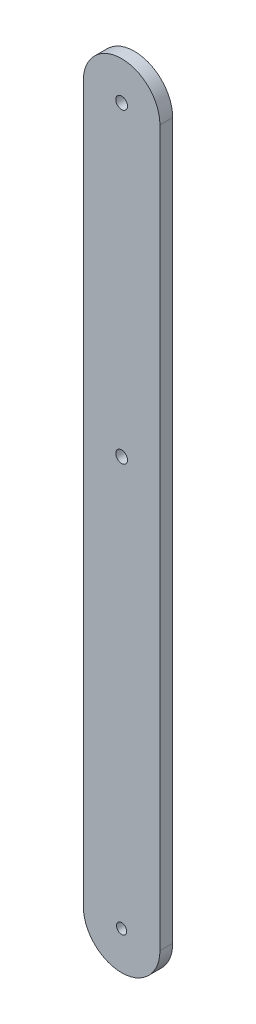
ISO-10303-21;
HEADER;
FILE_DESCRIPTION(('STEP AP214'),'2;1');
FILE_NAME('part.step','',(''),(''),'','','');
FILE_SCHEMA(('AUTOMOTIVE_DESIGN { 1 0 10303 214 1 1 1 1 }'));
ENDSEC;
DATA;
#1=APPLICATION_CONTEXT('core data for automotive mechanical design processes');
#2=APPLICATION_PROTOCOL_DEFINITION('international standard','automotive_design',2000,#1);
#3=PRODUCT_CONTEXT('',#1,'mechanical');
#4=PRODUCT('Part','Part','',(#3));
#5=PRODUCT_RELATED_PRODUCT_CATEGORY('part','',(#4));
#6=PRODUCT_DEFINITION_FORMATION('','',#4);
#7=PRODUCT_DEFINITION_CONTEXT('part definition',#1,'design');
#8=PRODUCT_DEFINITION('design','',#6,#7);
#9=PRODUCT_DEFINITION_SHAPE('','',#8);
#10=(LENGTH_UNIT() NAMED_UNIT(*) SI_UNIT(.MILLI.,.METRE.));
#11=(NAMED_UNIT(*) PLANE_ANGLE_UNIT() SI_UNIT($,.RADIAN.));
#12=(NAMED_UNIT(*) SI_UNIT($,.STERADIAN.) SOLID_ANGLE_UNIT());
#13=UNCERTAINTY_MEASURE_WITH_UNIT(LENGTH_MEASURE(1.E-05),#10,'distance_accuracy_value','');
#14=(GEOMETRIC_REPRESENTATION_CONTEXT(3) GLOBAL_UNCERTAINTY_ASSIGNED_CONTEXT((#13)) GLOBAL_UNIT_ASSIGNED_CONTEXT((#10,
#11,#12)) REPRESENTATION_CONTEXT('',''));
#15=CARTESIAN_POINT('',(0.,0.,0.));
#16=DIRECTION('',(0.,0.,1.));
#17=DIRECTION('',(1.,0.,0.));
#18=AXIS2_PLACEMENT_3D('',#15,#16,#17);
#19=CARTESIAN_POINT('',(-9.82801288749564,-25.4,3.175));
#20=DIRECTION('',(0.,0.,1.));
#21=DIRECTION('',(1.,0.,0.));
#22=AXIS2_PLACEMENT_3D('',#19,#20,#21);
#23=PLANE('',#22);
#24=CARTESIAN_POINT('',(-9.82801288749564,-25.4,3.175));
#25=DIRECTION('',(0.,0.,1.));
#26=DIRECTION('',(1.,0.,0.));
#27=AXIS2_PLACEMENT_3D('',#24,#25,#26);
#28=CIRCLE('',#27,1.27);
#29=CARTESIAN_POINT('',(-8.55801288749563,-25.4,3.175));
#30=VERTEX_POINT('',#29);
#31=EDGE_CURVE('E115',#30,#30,#28,.T.);
#32=ORIENTED_EDGE('',*,*,#31,.F.);
#33=EDGE_LOOP('',(#32));
#34=FACE_BOUND('',#33,.T.);
#35=CARTESIAN_POINT('',(-9.82801288749564,-25.4,3.175));
#36=DIRECTION('',(0.,0.,1.));
#37=DIRECTION('',(1.,0.,0.));
#38=AXIS2_PLACEMENT_3D('',#35,#36,#37);
#39=CIRCLE('',#38,9.52499999999999);
#40=CARTESIAN_POINT('',(-19.3530128874956,-25.4,3.175));
#41=VERTEX_POINT('',#40);
#42=CARTESIAN_POINT('',(-0.303012887495655,-25.4,3.175));
#43=VERTEX_POINT('',#42);
#44=EDGE_CURVE('E85',#41,#43,#39,.T.);
#45=ORIENTED_EDGE('',*,*,#44,.T.);
#46=DIRECTION('',(0.,1.,0.));
#47=VECTOR('',#46,1.);
#48=CARTESIAN_POINT('',(-0.303012887495678,152.4,3.175));
#49=LINE('',#48,#47);
#50=CARTESIAN_POINT('',(-0.303012887495699,152.4,3.175));
#51=VERTEX_POINT('',#50);
#52=EDGE_CURVE('E80',#43,#51,#49,.T.);
#53=ORIENTED_EDGE('',*,*,#52,.T.);
#54=CARTESIAN_POINT('',(-9.82801288749568,152.4,3.175));
#55=DIRECTION('',(0.,0.,1.));
#56=DIRECTION('',(-1.,0.,0.));
#57=AXIS2_PLACEMENT_3D('',#54,#55,#56);
#58=CIRCLE('',#57,9.52499999999998);
#59=CARTESIAN_POINT('',(-19.3530128874956,152.4,3.175));
#60=VERTEX_POINT('',#59);
#61=EDGE_CURVE('E83',#51,#60,#58,.T.);
#62=ORIENTED_EDGE('',*,*,#61,.T.);
#63=DIRECTION('',(0.,-1.,0.));
#64=VECTOR('',#63,1.);
#65=CARTESIAN_POINT('',(-19.3530128874956,-25.4,3.175));
#66=LINE('',#65,#64);
#67=EDGE_CURVE('E50',#60,#41,#66,.T.);
#68=ORIENTED_EDGE('',*,*,#67,.T.);
#69=EDGE_LOOP('',(#45,#53,#62,#68));
#70=FACE_BOUND('',#69,.T.);
#71=CARTESIAN_POINT('',(-9.82801288749568,152.4,3.175));
#72=DIRECTION('',(0.,0.,1.));
#73=DIRECTION('',(1.,0.,0.));
#74=AXIS2_PLACEMENT_3D('',#71,#72,#73);
#75=CIRCLE('',#74,1.4605);
#76=CARTESIAN_POINT('',(-8.36751288749568,152.4,3.175));
#77=VERTEX_POINT('',#76);
#78=EDGE_CURVE('E100',#77,#77,#75,.T.);
#79=ORIENTED_EDGE('',*,*,#78,.F.);
#80=EDGE_LOOP('',(#79));
#81=FACE_BOUND('',#80,.T.);
#82=CARTESIAN_POINT('',(-9.82801288749567,76.2,3.175));
#83=DIRECTION('',(0.,0.,1.));
#84=DIRECTION('',(1.,0.,0.));
#85=AXIS2_PLACEMENT_3D('',#82,#83,#84);
#86=CIRCLE('',#85,1.4605);
#87=CARTESIAN_POINT('',(-8.36751288749567,76.2,3.175));
#88=VERTEX_POINT('',#87);
#89=EDGE_CURVE('E121',#88,#88,#86,.T.);
#90=ORIENTED_EDGE('',*,*,#89,.F.);
#91=EDGE_LOOP('',(#90));
#92=FACE_BOUND('',#91,.T.);
#93=ADVANCED_FACE('F33',(#34,#70,#81,#92),#23,.T.);
#94=CARTESIAN_POINT('',(-9.82801288749564,-25.4,0.));
#95=DIRECTION('',(0.,0.,1.));
#96=DIRECTION('',(1.,0.,0.));
#97=AXIS2_PLACEMENT_3D('',#94,#95,#96);
#98=PLANE('',#97);
#99=CARTESIAN_POINT('',(-9.82801288749564,-25.4,0.));
#100=DIRECTION('',(0.,0.,1.));
#101=DIRECTION('',(1.,0.,0.));
#102=AXIS2_PLACEMENT_3D('',#99,#100,#101);
#103=CIRCLE('',#102,9.52499999999999);
#104=CARTESIAN_POINT('',(-19.3530128874956,-25.4,0.));
#105=VERTEX_POINT('',#104);
#106=CARTESIAN_POINT('',(-0.303012887495655,-25.4,0.));
#107=VERTEX_POINT('',#106);
#108=EDGE_CURVE('E97',#105,#107,#103,.T.);
#109=ORIENTED_EDGE('',*,*,#108,.F.);
#110=DIRECTION('',(0.,-1.,0.));
#111=VECTOR('',#110,1.);
#112=CARTESIAN_POINT('',(-19.3530128874956,-25.4,0.));
#113=LINE('',#112,#111);
#114=CARTESIAN_POINT('',(-19.3530128874956,152.4,0.));
#115=VERTEX_POINT('',#114);
#116=EDGE_CURVE('E73',#115,#105,#113,.T.);
#117=ORIENTED_EDGE('',*,*,#116,.F.);
#118=CARTESIAN_POINT('',(-9.82801288749568,152.4,0.));
#119=DIRECTION('',(0.,0.,1.));
#120=DIRECTION('',(-1.,0.,0.));
#121=AXIS2_PLACEMENT_3D('',#118,#119,#120);
#122=CIRCLE('',#121,9.52499999999998);
#123=CARTESIAN_POINT('',(-0.303012887495699,152.4,0.));
#124=VERTEX_POINT('',#123);
#125=EDGE_CURVE('E67',#124,#115,#122,.T.);
#126=ORIENTED_EDGE('',*,*,#125,.F.);
#127=DIRECTION('',(0.,1.,0.));
#128=VECTOR('',#127,1.);
#129=CARTESIAN_POINT('',(-0.303012887495678,152.4,0.));
#130=LINE('',#129,#128);
#131=EDGE_CURVE('E89',#107,#124,#130,.T.);
#132=ORIENTED_EDGE('',*,*,#131,.F.);
#133=EDGE_LOOP('',(#109,#117,#126,#132));
#134=FACE_BOUND('',#133,.T.);
#135=CARTESIAN_POINT('',(-9.82801288749568,152.4,0.));
#136=DIRECTION('',(0.,0.,1.));
#137=DIRECTION('',(1.,0.,0.));
#138=AXIS2_PLACEMENT_3D('',#135,#136,#137);
#139=CIRCLE('',#138,1.4605);
#140=CARTESIAN_POINT('',(-8.36751288749568,152.4,0.));
#141=VERTEX_POINT('',#140);
#142=EDGE_CURVE('E112',#141,#141,#139,.T.);
#143=ORIENTED_EDGE('',*,*,#142,.T.);
#144=EDGE_LOOP('',(#143));
#145=FACE_BOUND('',#144,.T.);
#146=CARTESIAN_POINT('',(-9.82801288749564,-25.4,0.));
#147=DIRECTION('',(0.,0.,1.));
#148=DIRECTION('',(1.,0.,0.));
#149=AXIS2_PLACEMENT_3D('',#146,#147,#148);
#150=CIRCLE('',#149,1.27);
#151=CARTESIAN_POINT('',(-8.55801288749563,-25.4,0.));
#152=VERTEX_POINT('',#151);
#153=EDGE_CURVE('E118',#152,#152,#150,.T.);
#154=ORIENTED_EDGE('',*,*,#153,.T.);
#155=EDGE_LOOP('',(#154));
#156=FACE_BOUND('',#155,.T.);
#157=CARTESIAN_POINT('',(-9.82801288749567,76.2,0.));
#158=DIRECTION('',(0.,0.,1.));
#159=DIRECTION('',(1.,0.,0.));
#160=AXIS2_PLACEMENT_3D('',#157,#158,#159);
#161=CIRCLE('',#160,1.4605);
#162=CARTESIAN_POINT('',(-8.36751288749567,76.2,0.));
#163=VERTEX_POINT('',#162);
#164=EDGE_CURVE('E124',#163,#163,#161,.T.);
#165=ORIENTED_EDGE('',*,*,#164,.T.);
#166=EDGE_LOOP('',(#165));
#167=FACE_BOUND('',#166,.T.);
#168=ADVANCED_FACE('F108',(#134,#145,#156,#167),#98,.F.);
#169=CARTESIAN_POINT('',(-9.82801288749564,-25.4,3.175));
#170=DIRECTION('',(0.,0.,-1.));
#171=DIRECTION('',(-1.,0.,0.));
#172=AXIS2_PLACEMENT_3D('',#169,#170,#171);
#173=CYLINDRICAL_SURFACE('',#172,9.52499999999999);
#174=ORIENTED_EDGE('',*,*,#108,.T.);
#175=DIRECTION('',(0.,0.,-1.));
#176=VECTOR('',#175,1.);
#177=CARTESIAN_POINT('',(-0.303012887495655,-25.4,3.175));
#178=LINE('',#177,#176);
#179=EDGE_CURVE('E11',#43,#107,#178,.T.);
#180=ORIENTED_EDGE('',*,*,#179,.F.);
#181=ORIENTED_EDGE('',*,*,#44,.F.);
#182=DIRECTION('',(0.,0.,-1.));
#183=VECTOR('',#182,1.);
#184=CARTESIAN_POINT('',(-19.3530128874956,-25.4,3.175));
#185=LINE('',#184,#183);
#186=EDGE_CURVE('E93',#41,#105,#185,.T.);
#187=ORIENTED_EDGE('',*,*,#186,.T.);
#188=EDGE_LOOP('',(#174,#180,#181,#187));
#189=FACE_BOUND('',#188,.T.);
#190=ADVANCED_FACE('F35',(#189),#173,.T.);
#191=CARTESIAN_POINT('',(-0.303012887495678,152.4,3.175));
#192=DIRECTION('',(-1.,0.,0.));
#193=DIRECTION('',(0.,-1.,0.));
#194=AXIS2_PLACEMENT_3D('',#191,#192,#193);
#195=PLANE('',#194);
#196=ORIENTED_EDGE('',*,*,#131,.T.);
#197=DIRECTION('',(0.,0.,-1.));
#198=VECTOR('',#197,1.);
#199=CARTESIAN_POINT('',(-0.303012887495699,152.4,3.175));
#200=LINE('',#199,#198);
#201=EDGE_CURVE('E42',#51,#124,#200,.T.);
#202=ORIENTED_EDGE('',*,*,#201,.F.);
#203=ORIENTED_EDGE('',*,*,#52,.F.);
#204=ORIENTED_EDGE('',*,*,#179,.T.);
#205=EDGE_LOOP('',(#196,#202,#203,#204));
#206=FACE_BOUND('',#205,.T.);
#207=ADVANCED_FACE('F88',(#206),#195,.F.);
#208=CARTESIAN_POINT('',(-9.82801288749568,152.4,3.175));
#209=DIRECTION('',(0.,0.,-1.));
#210=DIRECTION('',(-1.,0.,0.));
#211=AXIS2_PLACEMENT_3D('',#208,#209,#210);
#212=CYLINDRICAL_SURFACE('',#211,9.52499999999998);
#213=ORIENTED_EDGE('',*,*,#125,.T.);
#214=DIRECTION('',(0.,0.,-1.));
#215=VECTOR('',#214,1.);
#216=CARTESIAN_POINT('',(-19.3530128874956,152.4,3.175));
#217=LINE('',#216,#215);
#218=EDGE_CURVE('E90',#60,#115,#217,.T.);
#219=ORIENTED_EDGE('',*,*,#218,.F.);
#220=ORIENTED_EDGE('',*,*,#61,.F.);
#221=ORIENTED_EDGE('',*,*,#201,.T.);
#222=EDGE_LOOP('',(#213,#219,#220,#221));
#223=FACE_BOUND('',#222,.T.);
#224=ADVANCED_FACE('F91',(#223),#212,.T.);
#225=CARTESIAN_POINT('',(-19.3530128874956,-25.4,3.175));
#226=DIRECTION('',(1.,0.,0.));
#227=DIRECTION('',(0.,1.,0.));
#228=AXIS2_PLACEMENT_3D('',#225,#226,#227);
#229=PLANE('',#228);
#230=ORIENTED_EDGE('',*,*,#116,.T.);
#231=ORIENTED_EDGE('',*,*,#186,.F.);
#232=ORIENTED_EDGE('',*,*,#67,.F.);
#233=ORIENTED_EDGE('',*,*,#218,.T.);
#234=EDGE_LOOP('',(#230,#231,#232,#233));
#235=FACE_BOUND('',#234,.T.);
#236=ADVANCED_FACE('F105',(#235),#229,.F.);
#237=CARTESIAN_POINT('',(-9.82801288749568,152.4,3.175));
#238=DIRECTION('',(0.,0.,-1.));
#239=DIRECTION('',(-1.,0.,0.));
#240=AXIS2_PLACEMENT_3D('',#237,#238,#239);
#241=CYLINDRICAL_SURFACE('',#240,1.4605);
#242=ORIENTED_EDGE('',*,*,#78,.T.);
#243=EDGE_LOOP('',(#242));
#244=FACE_BOUND('',#243,.T.);
#245=ORIENTED_EDGE('',*,*,#142,.F.);
#246=EDGE_LOOP('',(#245));
#247=FACE_BOUND('',#246,.T.);
#248=ADVANCED_FACE('F142',(#244,#247),#241,.F.);
#249=CARTESIAN_POINT('',(-9.82801288749564,-25.4,3.175));
#250=DIRECTION('',(0.,0.,-1.));
#251=DIRECTION('',(-1.,0.,0.));
#252=AXIS2_PLACEMENT_3D('',#249,#250,#251);
#253=CYLINDRICAL_SURFACE('',#252,1.27);
#254=ORIENTED_EDGE('',*,*,#31,.T.);
#255=EDGE_LOOP('',(#254));
#256=FACE_BOUND('',#255,.T.);
#257=ORIENTED_EDGE('',*,*,#153,.F.);
#258=EDGE_LOOP('',(#257));
#259=FACE_BOUND('',#258,.T.);
#260=ADVANCED_FACE('F188',(#256,#259),#253,.F.);
#261=CARTESIAN_POINT('',(-9.82801288749567,76.2,3.175));
#262=DIRECTION('',(0.,0.,-1.));
#263=DIRECTION('',(-1.,0.,0.));
#264=AXIS2_PLACEMENT_3D('',#261,#262,#263);
#265=CYLINDRICAL_SURFACE('',#264,1.4605);
#266=ORIENTED_EDGE('',*,*,#89,.T.);
#267=EDGE_LOOP('',(#266));
#268=FACE_BOUND('',#267,.T.);
#269=ORIENTED_EDGE('',*,*,#164,.F.);
#270=EDGE_LOOP('',(#269));
#271=FACE_BOUND('',#270,.T.);
#272=ADVANCED_FACE('F130',(#268,#271),#265,.F.);
#273=CLOSED_SHELL('',(#93,#168,#190,#207,#224,#236,#248,#260,#272));
#274=MANIFOLD_SOLID_BREP('B2',#273);
#275=ADVANCED_BREP_SHAPE_REPRESENTATION('',(#18,#274),#14);
#276=SHAPE_DEFINITION_REPRESENTATION(#9,#275);
ENDSEC;
END-ISO-10303-21;
